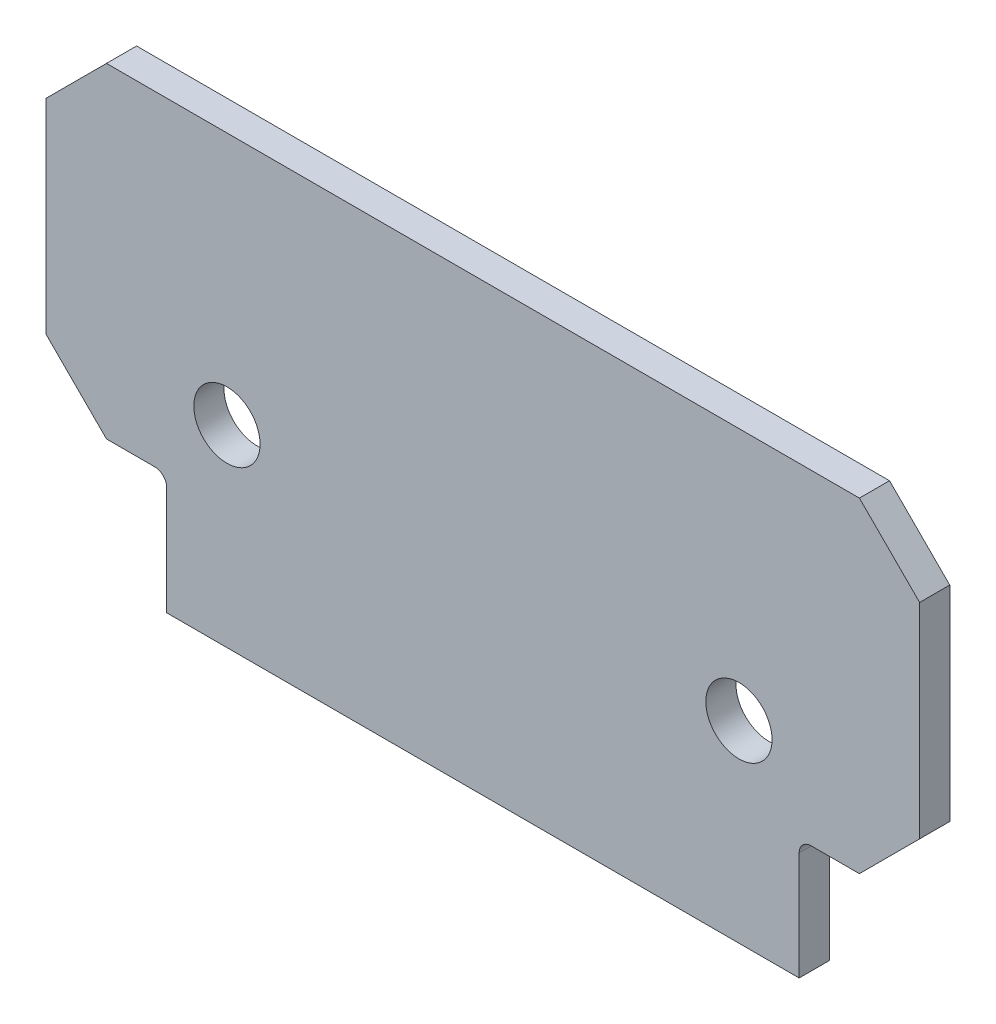
ISO-10303-21;
HEADER;
FILE_DESCRIPTION(('STEP AP214'),'2;1');
FILE_NAME('part.step','',(''),(''),'','','');
FILE_SCHEMA(('AUTOMOTIVE_DESIGN { 1 0 10303 214 1 1 1 1 }'));
ENDSEC;
DATA;
#1=APPLICATION_CONTEXT('core data for automotive mechanical design processes');
#2=APPLICATION_PROTOCOL_DEFINITION('international standard','automotive_design',2000,#1);
#3=PRODUCT_CONTEXT('',#1,'mechanical');
#4=PRODUCT('Part','Part','',(#3));
#5=PRODUCT_RELATED_PRODUCT_CATEGORY('part','',(#4));
#6=PRODUCT_DEFINITION_FORMATION('','',#4);
#7=PRODUCT_DEFINITION_CONTEXT('part definition',#1,'design');
#8=PRODUCT_DEFINITION('design','',#6,#7);
#9=PRODUCT_DEFINITION_SHAPE('','',#8);
#10=(LENGTH_UNIT() NAMED_UNIT(*) SI_UNIT(.MILLI.,.METRE.));
#11=(NAMED_UNIT(*) PLANE_ANGLE_UNIT() SI_UNIT($,.RADIAN.));
#12=(NAMED_UNIT(*) SI_UNIT($,.STERADIAN.) SOLID_ANGLE_UNIT());
#13=UNCERTAINTY_MEASURE_WITH_UNIT(LENGTH_MEASURE(1.E-05),#10,'distance_accuracy_value','');
#14=(GEOMETRIC_REPRESENTATION_CONTEXT(3) GLOBAL_UNCERTAINTY_ASSIGNED_CONTEXT((#13)) GLOBAL_UNIT_ASSIGNED_CONTEXT((#10,
#11,#12)) REPRESENTATION_CONTEXT('',''));
#15=CARTESIAN_POINT('',(0.,0.,0.));
#16=DIRECTION('',(0.,0.,1.));
#17=DIRECTION('',(1.,0.,0.));
#18=AXIS2_PLACEMENT_3D('',#15,#16,#17);
#19=CARTESIAN_POINT('',(0.,-2.2,0.25));
#20=DIRECTION('',(0.,-1.,0.));
#21=DIRECTION('',(1.,0.,0.));
#22=AXIS2_PLACEMENT_3D('',#19,#20,#21);
#23=PLANE('',#22);
#24=DIRECTION('',(-1.,0.,0.));
#25=VECTOR('',#24,1.);
#26=CARTESIAN_POINT('',(0.,-2.2,0.));
#27=LINE('',#26,#25);
#28=CARTESIAN_POINT('',(2.625,-2.2,0.));
#29=VERTEX_POINT('',#28);
#30=CARTESIAN_POINT('',(-2.625,-2.2,0.));
#31=VERTEX_POINT('',#30);
#32=EDGE_CURVE('E258',#29,#31,#27,.T.);
#33=ORIENTED_EDGE('',*,*,#32,.F.);
#34=DIRECTION('',(0.,0.,-1.));
#35=VECTOR('',#34,1.);
#36=CARTESIAN_POINT('',(2.625,-2.2,0.25));
#37=LINE('',#36,#35);
#38=CARTESIAN_POINT('',(2.625,-2.2,0.25));
#39=VERTEX_POINT('',#38);
#40=EDGE_CURVE('E256',#39,#29,#37,.T.);
#41=ORIENTED_EDGE('',*,*,#40,.F.);
#42=DIRECTION('',(-1.,0.,0.));
#43=VECTOR('',#42,1.);
#44=CARTESIAN_POINT('',(0.,-2.2,0.25));
#45=LINE('',#44,#43);
#46=CARTESIAN_POINT('',(-2.625,-2.2,0.25));
#47=VERTEX_POINT('',#46);
#48=EDGE_CURVE('E238',#39,#47,#45,.T.);
#49=ORIENTED_EDGE('',*,*,#48,.T.);
#50=DIRECTION('',(0.,0.,-1.));
#51=VECTOR('',#50,1.);
#52=CARTESIAN_POINT('',(-2.625,-2.2,0.25));
#53=LINE('',#52,#51);
#54=EDGE_CURVE('E277',#47,#31,#53,.T.);
#55=ORIENTED_EDGE('',*,*,#54,.T.);
#56=EDGE_LOOP('',(#33,#41,#49,#55));
#57=FACE_BOUND('',#56,.T.);
#58=ADVANCED_FACE('F63',(#57),#23,.T.);
#59=CARTESIAN_POINT('',(2.625,0.,0.25));
#60=DIRECTION('',(1.,0.,0.));
#61=DIRECTION('',(0.,0.,-1.));
#62=AXIS2_PLACEMENT_3D('',#59,#60,#61);
#63=PLANE('',#62);
#64=DIRECTION('',(0.,-1.,0.));
#65=VECTOR('',#64,1.);
#66=CARTESIAN_POINT('',(2.625,0.,0.));
#67=LINE('',#66,#65);
#68=CARTESIAN_POINT('',(2.625,-1.3,0.));
#69=VERTEX_POINT('',#68);
#70=EDGE_CURVE('E261',#69,#29,#67,.T.);
#71=ORIENTED_EDGE('',*,*,#70,.F.);
#72=DIRECTION('',(0.,0.,-1.));
#73=VECTOR('',#72,1.);
#74=CARTESIAN_POINT('',(2.625,-1.3,0.25));
#75=LINE('',#74,#73);
#76=CARTESIAN_POINT('',(2.625,-1.3,0.25));
#77=VERTEX_POINT('',#76);
#78=EDGE_CURVE('E291',#69,#77,#75,.F.);
#79=ORIENTED_EDGE('',*,*,#78,.T.);
#80=DIRECTION('',(0.,-1.,0.));
#81=VECTOR('',#80,1.);
#82=CARTESIAN_POINT('',(2.625,0.,0.25));
#83=LINE('',#82,#81);
#84=EDGE_CURVE('E242',#77,#39,#83,.T.);
#85=ORIENTED_EDGE('',*,*,#84,.T.);
#86=ORIENTED_EDGE('',*,*,#40,.T.);
#87=EDGE_LOOP('',(#71,#79,#85,#86));
#88=FACE_BOUND('',#87,.T.);
#89=ADVANCED_FACE('F397',(#88),#63,.T.);
#90=CARTESIAN_POINT('',(0.,-1.2,0.25));
#91=DIRECTION('',(0.,-1.,0.));
#92=DIRECTION('',(0.,0.,-1.));
#93=AXIS2_PLACEMENT_3D('',#90,#91,#92);
#94=PLANE('',#93);
#95=DIRECTION('',(-1.,0.,0.));
#96=VECTOR('',#95,1.);
#97=CARTESIAN_POINT('',(0.,-1.2,0.));
#98=LINE('',#97,#96);
#99=CARTESIAN_POINT('',(3.125,-1.2,0.));
#100=VERTEX_POINT('',#99);
#101=CARTESIAN_POINT('',(2.725,-1.2,0.));
#102=VERTEX_POINT('',#101);
#103=EDGE_CURVE('E263',#100,#102,#98,.T.);
#104=ORIENTED_EDGE('',*,*,#103,.F.);
#105=DIRECTION('',(0.,0.,1.));
#106=VECTOR('',#105,1.);
#107=CARTESIAN_POINT('',(3.125,-1.2,0.25));
#108=LINE('',#107,#106);
#109=CARTESIAN_POINT('',(3.125,-1.2,0.25));
#110=VERTEX_POINT('',#109);
#111=EDGE_CURVE('E12',#100,#110,#108,.T.);
#112=ORIENTED_EDGE('',*,*,#111,.T.);
#113=DIRECTION('',(-1.,0.,0.));
#114=VECTOR('',#113,1.);
#115=CARTESIAN_POINT('',(0.,-1.2,0.25));
#116=LINE('',#115,#114);
#117=CARTESIAN_POINT('',(2.725,-1.2,0.25));
#118=VERTEX_POINT('',#117);
#119=EDGE_CURVE('E244',#110,#118,#116,.T.);
#120=ORIENTED_EDGE('',*,*,#119,.T.);
#121=DIRECTION('',(0.,0.,-1.));
#122=VECTOR('',#121,1.);
#123=CARTESIAN_POINT('',(2.725,-1.2,0.));
#124=LINE('',#123,#122);
#125=EDGE_CURVE('E288',#118,#102,#124,.T.);
#126=ORIENTED_EDGE('',*,*,#125,.T.);
#127=EDGE_LOOP('',(#104,#112,#120,#126));
#128=FACE_BOUND('',#127,.T.);
#129=ADVANCED_FACE('F387',(#128),#94,.T.);
#130=CARTESIAN_POINT('',(3.625,0.,0.25));
#131=DIRECTION('',(1.,0.,0.));
#132=DIRECTION('',(0.,1.,0.));
#133=AXIS2_PLACEMENT_3D('',#130,#131,#132);
#134=PLANE('',#133);
#135=DIRECTION('',(0.,-1.,0.));
#136=VECTOR('',#135,1.);
#137=CARTESIAN_POINT('',(3.625,0.,0.25));
#138=LINE('',#137,#136);
#139=CARTESIAN_POINT('',(3.625,0.999999999999998,0.25));
#140=VERTEX_POINT('',#139);
#141=CARTESIAN_POINT('',(3.625,-0.700000000000001,0.25));
#142=VERTEX_POINT('',#141);
#143=EDGE_CURVE('E246',#140,#142,#138,.T.);
#144=ORIENTED_EDGE('',*,*,#143,.T.);
#145=DIRECTION('',(0.,0.,-1.));
#146=VECTOR('',#145,1.);
#147=CARTESIAN_POINT('',(3.625,-0.700000000000001,0.25));
#148=LINE('',#147,#146);
#149=CARTESIAN_POINT('',(3.625,-0.700000000000001,0.));
#150=VERTEX_POINT('',#149);
#151=EDGE_CURVE('E71',#142,#150,#148,.T.);
#152=ORIENTED_EDGE('',*,*,#151,.T.);
#153=DIRECTION('',(0.,-1.,0.));
#154=VECTOR('',#153,1.);
#155=CARTESIAN_POINT('',(3.625,0.,0.));
#156=LINE('',#155,#154);
#157=CARTESIAN_POINT('',(3.625,0.999999999999998,0.));
#158=VERTEX_POINT('',#157);
#159=EDGE_CURVE('E265',#158,#150,#156,.T.);
#160=ORIENTED_EDGE('',*,*,#159,.F.);
#161=DIRECTION('',(0.,0.,1.));
#162=VECTOR('',#161,1.);
#163=CARTESIAN_POINT('',(3.625,0.999999999999998,0.25));
#164=LINE('',#163,#162);
#165=EDGE_CURVE('E330',#158,#140,#164,.T.);
#166=ORIENTED_EDGE('',*,*,#165,.T.);
#167=EDGE_LOOP('',(#144,#152,#160,#166));
#168=FACE_BOUND('',#167,.T.);
#169=ADVANCED_FACE('F335',(#168),#134,.T.);
#170=CARTESIAN_POINT('',(0.,1.5,0.25));
#171=DIRECTION('',(0.,1.,0.));
#172=DIRECTION('',(-1.,0.,0.));
#173=AXIS2_PLACEMENT_3D('',#170,#171,#172);
#174=PLANE('',#173);
#175=DIRECTION('',(1.,0.,0.));
#176=VECTOR('',#175,1.);
#177=CARTESIAN_POINT('',(0.,1.5,0.));
#178=LINE('',#177,#176);
#179=CARTESIAN_POINT('',(-3.125,1.5,0.));
#180=VERTEX_POINT('',#179);
#181=CARTESIAN_POINT('',(3.125,1.5,0.));
#182=VERTEX_POINT('',#181);
#183=EDGE_CURVE('E268',#180,#182,#178,.T.);
#184=ORIENTED_EDGE('',*,*,#183,.F.);
#185=DIRECTION('',(0.,0.,1.));
#186=VECTOR('',#185,1.);
#187=CARTESIAN_POINT('',(-3.125,1.5,0.25));
#188=LINE('',#187,#186);
#189=CARTESIAN_POINT('',(-3.125,1.5,0.25));
#190=VERTEX_POINT('',#189);
#191=EDGE_CURVE('E85',#180,#190,#188,.T.);
#192=ORIENTED_EDGE('',*,*,#191,.T.);
#193=DIRECTION('',(1.,0.,0.));
#194=VECTOR('',#193,1.);
#195=CARTESIAN_POINT('',(0.,1.5,0.25));
#196=LINE('',#195,#194);
#197=CARTESIAN_POINT('',(3.125,1.5,0.25));
#198=VERTEX_POINT('',#197);
#199=EDGE_CURVE('E249',#190,#198,#196,.T.);
#200=ORIENTED_EDGE('',*,*,#199,.T.);
#201=DIRECTION('',(0.,0.,-1.));
#202=VECTOR('',#201,1.);
#203=CARTESIAN_POINT('',(3.125,1.5,0.25));
#204=LINE('',#203,#202);
#205=EDGE_CURVE('E326',#198,#182,#204,.T.);
#206=ORIENTED_EDGE('',*,*,#205,.T.);
#207=EDGE_LOOP('',(#184,#192,#200,#206));
#208=FACE_BOUND('',#207,.T.);
#209=ADVANCED_FACE('F345',(#208),#174,.T.);
#210=CARTESIAN_POINT('',(-3.625,0.,0.25));
#211=DIRECTION('',(1.,0.,0.));
#212=DIRECTION('',(0.,1.,0.));
#213=AXIS2_PLACEMENT_3D('',#210,#211,#212);
#214=PLANE('',#213);
#215=DIRECTION('',(0.,-1.,0.));
#216=VECTOR('',#215,1.);
#217=CARTESIAN_POINT('',(-3.625,0.,0.));
#218=LINE('',#217,#216);
#219=CARTESIAN_POINT('',(-3.625,1.,0.));
#220=VERTEX_POINT('',#219);
#221=CARTESIAN_POINT('',(-3.625,-0.699999999999998,0.));
#222=VERTEX_POINT('',#221);
#223=EDGE_CURVE('E271',#220,#222,#218,.T.);
#224=ORIENTED_EDGE('',*,*,#223,.T.);
#225=DIRECTION('',(0.,0.,1.));
#226=VECTOR('',#225,1.);
#227=CARTESIAN_POINT('',(-3.625,-0.699999999999998,0.25));
#228=LINE('',#227,#226);
#229=CARTESIAN_POINT('',(-3.625,-0.699999999999998,0.25));
#230=VERTEX_POINT('',#229);
#231=EDGE_CURVE('E317',#222,#230,#228,.T.);
#232=ORIENTED_EDGE('',*,*,#231,.T.);
#233=DIRECTION('',(0.,-1.,0.));
#234=VECTOR('',#233,1.);
#235=CARTESIAN_POINT('',(-3.625,0.,0.25));
#236=LINE('',#235,#234);
#237=CARTESIAN_POINT('',(-3.625,1.,0.25));
#238=VERTEX_POINT('',#237);
#239=EDGE_CURVE('E251',#238,#230,#236,.T.);
#240=ORIENTED_EDGE('',*,*,#239,.F.);
#241=DIRECTION('',(0.,0.,-1.));
#242=VECTOR('',#241,1.);
#243=CARTESIAN_POINT('',(-3.625,1.,0.));
#244=LINE('',#243,#242);
#245=EDGE_CURVE('E314',#238,#220,#244,.T.);
#246=ORIENTED_EDGE('',*,*,#245,.T.);
#247=EDGE_LOOP('',(#224,#232,#240,#246));
#248=FACE_BOUND('',#247,.T.);
#249=ADVANCED_FACE('F354',(#248),#214,.F.);
#250=CARTESIAN_POINT('',(0.,-1.2,0.25));
#251=DIRECTION('',(0.,1.,0.));
#252=DIRECTION('',(0.,0.,1.));
#253=AXIS2_PLACEMENT_3D('',#250,#251,#252);
#254=PLANE('',#253);
#255=DIRECTION('',(1.,0.,0.));
#256=VECTOR('',#255,1.);
#257=CARTESIAN_POINT('',(0.,-1.2,0.25));
#258=LINE('',#257,#256);
#259=CARTESIAN_POINT('',(-3.125,-1.2,0.25));
#260=VERTEX_POINT('',#259);
#261=CARTESIAN_POINT('',(-2.725,-1.2,0.25));
#262=VERTEX_POINT('',#261);
#263=EDGE_CURVE('E254',#260,#262,#258,.T.);
#264=ORIENTED_EDGE('',*,*,#263,.F.);
#265=DIRECTION('',(0.,0.,-1.));
#266=VECTOR('',#265,1.);
#267=CARTESIAN_POINT('',(-3.125,-1.2,0.25));
#268=LINE('',#267,#266);
#269=CARTESIAN_POINT('',(-3.125,-1.2,0.));
#270=VERTEX_POINT('',#269);
#271=EDGE_CURVE('E303',#260,#270,#268,.T.);
#272=ORIENTED_EDGE('',*,*,#271,.T.);
#273=DIRECTION('',(1.,0.,0.));
#274=VECTOR('',#273,1.);
#275=CARTESIAN_POINT('',(0.,-1.2,0.));
#276=LINE('',#275,#274);
#277=CARTESIAN_POINT('',(-2.725,-1.2,0.));
#278=VERTEX_POINT('',#277);
#279=EDGE_CURVE('E239',#270,#278,#276,.T.);
#280=ORIENTED_EDGE('',*,*,#279,.T.);
#281=DIRECTION('',(0.,0.,-1.));
#282=VECTOR('',#281,1.);
#283=CARTESIAN_POINT('',(-2.725,-1.2,0.25));
#284=LINE('',#283,#282);
#285=EDGE_CURVE('E285',#278,#262,#284,.F.);
#286=ORIENTED_EDGE('',*,*,#285,.T.);
#287=EDGE_LOOP('',(#264,#272,#280,#286));
#288=FACE_BOUND('',#287,.T.);
#289=ADVANCED_FACE('F362',(#288),#254,.F.);
#290=CARTESIAN_POINT('',(-2.625,0.,0.25));
#291=DIRECTION('',(1.,0.,0.));
#292=DIRECTION('',(0.,0.,-1.));
#293=AXIS2_PLACEMENT_3D('',#290,#291,#292);
#294=PLANE('',#293);
#295=DIRECTION('',(0.,-1.,0.));
#296=VECTOR('',#295,1.);
#297=CARTESIAN_POINT('',(-2.625,0.,0.25));
#298=LINE('',#297,#296);
#299=CARTESIAN_POINT('',(-2.625,-1.3,0.25));
#300=VERTEX_POINT('',#299);
#301=EDGE_CURVE('E236',#300,#47,#298,.T.);
#302=ORIENTED_EDGE('',*,*,#301,.F.);
#303=DIRECTION('',(0.,0.,-1.));
#304=VECTOR('',#303,1.);
#305=CARTESIAN_POINT('',(-2.625,-1.3,0.));
#306=LINE('',#305,#304);
#307=CARTESIAN_POINT('',(-2.625,-1.3,0.));
#308=VERTEX_POINT('',#307);
#309=EDGE_CURVE('E280',#300,#308,#306,.T.);
#310=ORIENTED_EDGE('',*,*,#309,.T.);
#311=DIRECTION('',(0.,-1.,0.));
#312=VECTOR('',#311,1.);
#313=CARTESIAN_POINT('',(-2.625,0.,0.));
#314=LINE('',#313,#312);
#315=EDGE_CURVE('E232',#308,#31,#314,.T.);
#316=ORIENTED_EDGE('',*,*,#315,.T.);
#317=ORIENTED_EDGE('',*,*,#54,.F.);
#318=EDGE_LOOP('',(#302,#310,#316,#317));
#319=FACE_BOUND('',#318,.T.);
#320=ADVANCED_FACE('F371',(#319),#294,.F.);
#321=CARTESIAN_POINT('',(0.,0.,0.));
#322=DIRECTION('',(0.,0.,1.));
#323=DIRECTION('',(1.,0.,0.));
#324=AXIS2_PLACEMENT_3D('',#321,#322,#323);
#325=PLANE('',#324);
#326=CARTESIAN_POINT('',(-2.12499999999998,-0.600000000000007,0.));
#327=DIRECTION('',(0.,0.,1.));
#328=DIRECTION('',(1.,0.,0.));
#329=AXIS2_PLACEMENT_3D('',#326,#327,#328);
#330=CIRCLE('',#329,0.274999999999993);
#331=CARTESIAN_POINT('',(-1.84999999999999,-0.600000000000007,0.));
#332=VERTEX_POINT('',#331);
#333=EDGE_CURVE('E632',#332,#332,#330,.T.);
#334=ORIENTED_EDGE('',*,*,#333,.T.);
#335=EDGE_LOOP('',(#334));
#336=FACE_BOUND('',#335,.T.);
#337=CARTESIAN_POINT('',(2.12500000000001,-0.6,0.));
#338=DIRECTION('',(0.,0.,1.));
#339=DIRECTION('',(1.,0.,0.));
#340=AXIS2_PLACEMENT_3D('',#337,#338,#339);
#341=CIRCLE('',#340,0.274999999999994);
#342=CARTESIAN_POINT('',(2.4,-0.6,0.));
#343=VERTEX_POINT('',#342);
#344=EDGE_CURVE('E228',#343,#343,#341,.T.);
#345=ORIENTED_EDGE('',*,*,#344,.T.);
#346=EDGE_LOOP('',(#345));
#347=FACE_BOUND('',#346,.T.);
#348=DIRECTION('',(0.5,-0.866025403784439,0.));
#349=VECTOR('',#348,1.);
#350=CARTESIAN_POINT('',(-0.720993649053893,-0.416265877365276,0.));
#351=LINE('',#350,#349);
#352=CARTESIAN_POINT('',(-1.25,0.500000000000001,0.));
#353=VERTEX_POINT('',#352);
#354=CARTESIAN_POINT('',(-0.961324865405191,0.,0.));
#355=VERTEX_POINT('',#354);
#356=EDGE_CURVE('E215',#353,#355,#351,.T.);
#357=ORIENTED_EDGE('',*,*,#356,.T.);
#358=DIRECTION('',(1.,0.,0.));
#359=VECTOR('',#358,1.);
#360=CARTESIAN_POINT('',(0.,0.,0.));
#361=LINE('',#360,#359);
#362=CARTESIAN_POINT('',(0.961324865405186,0.,0.));
#363=VERTEX_POINT('',#362);
#364=EDGE_CURVE('E226',#355,#363,#361,.T.);
#365=ORIENTED_EDGE('',*,*,#364,.T.);
#366=DIRECTION('',(0.5,0.866025403784439,0.));
#367=VECTOR('',#366,1.);
#368=CARTESIAN_POINT('',(0.72099364905389,-0.416265877365274,0.));
#369=LINE('',#368,#367);
#370=CARTESIAN_POINT('',(1.25,0.5,0.));
#371=VERTEX_POINT('',#370);
#372=EDGE_CURVE('E195',#363,#371,#369,.T.);
#373=ORIENTED_EDGE('',*,*,#372,.T.);
#374=DIRECTION('',(1.,0.,0.));
#375=VECTOR('',#374,1.);
#376=CARTESIAN_POINT('',(0.,0.500000000000001,0.));
#377=LINE('',#376,#375);
#378=EDGE_CURVE('E218',#353,#371,#377,.T.);
#379=ORIENTED_EDGE('',*,*,#378,.F.);
#380=EDGE_LOOP('',(#357,#365,#373,#379));
#381=FACE_BOUND('',#380,.T.);
#382=ORIENTED_EDGE('',*,*,#279,.F.);
#383=DIRECTION('',(0.707106781186546,-0.707106781186549,0.));
#384=VECTOR('',#383,1.);
#385=CARTESIAN_POINT('',(-3.125,-1.2,0.));
#386=LINE('',#385,#384);
#387=EDGE_CURVE('E312',#270,#222,#386,.F.);
#388=ORIENTED_EDGE('',*,*,#387,.T.);
#389=ORIENTED_EDGE('',*,*,#223,.F.);
#390=DIRECTION('',(0.707106781186549,0.707106781186546,0.));
#391=VECTOR('',#390,1.);
#392=CARTESIAN_POINT('',(-3.625,1.,0.));
#393=LINE('',#392,#391);
#394=EDGE_CURVE('E310',#220,#180,#393,.T.);
#395=ORIENTED_EDGE('',*,*,#394,.T.);
#396=ORIENTED_EDGE('',*,*,#183,.T.);
#397=DIRECTION('',(-0.707106781186546,0.707106781186549,0.));
#398=VECTOR('',#397,1.);
#399=CARTESIAN_POINT('',(3.125,1.5,0.));
#400=LINE('',#399,#398);
#401=EDGE_CURVE('E306',#182,#158,#400,.F.);
#402=ORIENTED_EDGE('',*,*,#401,.T.);
#403=ORIENTED_EDGE('',*,*,#159,.T.);
#404=DIRECTION('',(0.707106781186549,0.707106781186546,0.));
#405=VECTOR('',#404,1.);
#406=CARTESIAN_POINT('',(3.625,-0.700000000000001,0.));
#407=LINE('',#406,#405);
#408=EDGE_CURVE('E308',#150,#100,#407,.F.);
#409=ORIENTED_EDGE('',*,*,#408,.T.);
#410=ORIENTED_EDGE('',*,*,#103,.T.);
#411=CARTESIAN_POINT('',(2.725,-1.3,0.));
#412=DIRECTION('',(0.,0.,1.));
#413=DIRECTION('',(1.,0.,0.));
#414=AXIS2_PLACEMENT_3D('',#411,#412,#413);
#415=CIRCLE('',#414,0.1);
#416=EDGE_CURVE('E298',#102,#69,#415,.T.);
#417=ORIENTED_EDGE('',*,*,#416,.T.);
#418=ORIENTED_EDGE('',*,*,#70,.T.);
#419=ORIENTED_EDGE('',*,*,#32,.T.);
#420=ORIENTED_EDGE('',*,*,#315,.F.);
#421=CARTESIAN_POINT('',(-2.725,-1.3,0.));
#422=DIRECTION('',(0.,0.,1.));
#423=DIRECTION('',(1.,0.,0.));
#424=AXIS2_PLACEMENT_3D('',#421,#422,#423);
#425=CIRCLE('',#424,0.1);
#426=EDGE_CURVE('E293',#308,#278,#425,.T.);
#427=ORIENTED_EDGE('',*,*,#426,.T.);
#428=EDGE_LOOP('',(#382,#388,#389,#395,#396,#402,#403,#409,#410,#417,#418,#419,#420,#427));
#429=FACE_BOUND('',#428,.T.);
#430=ADVANCED_FACE('F341',(#336,#347,#381,#429),#325,.F.);
#431=CARTESIAN_POINT('',(0.,0.,0.25));
#432=DIRECTION('',(0.,0.,1.));
#433=DIRECTION('',(1.,0.,0.));
#434=AXIS2_PLACEMENT_3D('',#431,#432,#433);
#435=PLANE('',#434);
#436=CARTESIAN_POINT('',(-2.12499999999998,-0.600000000000007,0.250000000000001));
#437=DIRECTION('',(0.,0.,1.));
#438=DIRECTION('',(1.,0.,0.));
#439=AXIS2_PLACEMENT_3D('',#436,#437,#438);
#440=CIRCLE('',#439,0.274999999999987);
#441=CARTESIAN_POINT('',(-1.84999999999999,-0.600000000000007,0.250000000000001));
#442=VERTEX_POINT('',#441);
#443=EDGE_CURVE('E629',#442,#442,#440,.T.);
#444=ORIENTED_EDGE('',*,*,#443,.F.);
#445=EDGE_LOOP('',(#444));
#446=FACE_BOUND('',#445,.T.);
#447=CARTESIAN_POINT('',(2.12500000000001,-0.6,0.250000000000001));
#448=DIRECTION('',(0.,0.,1.));
#449=DIRECTION('',(1.,0.,0.));
#450=AXIS2_PLACEMENT_3D('',#447,#448,#449);
#451=CIRCLE('',#450,0.274999999999987);
#452=CARTESIAN_POINT('',(2.4,-0.6,0.250000000000001));
#453=VERTEX_POINT('',#452);
#454=EDGE_CURVE('E221',#453,#453,#451,.T.);
#455=ORIENTED_EDGE('',*,*,#454,.F.);
#456=EDGE_LOOP('',(#455));
#457=FACE_BOUND('',#456,.T.);
#458=ORIENTED_EDGE('',*,*,#239,.T.);
#459=DIRECTION('',(-0.707106781186546,0.707106781186549,0.));
#460=VECTOR('',#459,1.);
#461=CARTESIAN_POINT('',(-2.16250000000001,-2.1625,0.25));
#462=LINE('',#461,#460);
#463=EDGE_CURVE('E324',#230,#260,#462,.F.);
#464=ORIENTED_EDGE('',*,*,#463,.T.);
#465=ORIENTED_EDGE('',*,*,#263,.T.);
#466=CARTESIAN_POINT('',(-2.725,-1.3,0.25));
#467=DIRECTION('',(0.,0.,1.));
#468=DIRECTION('',(1.,0.,0.));
#469=AXIS2_PLACEMENT_3D('',#466,#467,#468);
#470=CIRCLE('',#469,0.1);
#471=EDGE_CURVE('E296',#262,#300,#470,.F.);
#472=ORIENTED_EDGE('',*,*,#471,.T.);
#473=ORIENTED_EDGE('',*,*,#301,.T.);
#474=ORIENTED_EDGE('',*,*,#48,.F.);
#475=ORIENTED_EDGE('',*,*,#84,.F.);
#476=CARTESIAN_POINT('',(2.725,-1.3,0.25));
#477=DIRECTION('',(0.,0.,1.));
#478=DIRECTION('',(1.,0.,0.));
#479=AXIS2_PLACEMENT_3D('',#476,#477,#478);
#480=CIRCLE('',#479,0.1);
#481=EDGE_CURVE('E300',#77,#118,#480,.F.);
#482=ORIENTED_EDGE('',*,*,#481,.T.);
#483=ORIENTED_EDGE('',*,*,#119,.F.);
#484=DIRECTION('',(-0.707106781186549,-0.707106781186546,0.));
#485=VECTOR('',#484,1.);
#486=CARTESIAN_POINT('',(2.16249999999999,-2.1625,0.25));
#487=LINE('',#486,#485);
#488=EDGE_CURVE('E320',#110,#142,#487,.F.);
#489=ORIENTED_EDGE('',*,*,#488,.T.);
#490=ORIENTED_EDGE('',*,*,#143,.F.);
#491=DIRECTION('',(0.707106781186546,-0.707106781186549,0.));
#492=VECTOR('',#491,1.);
#493=CARTESIAN_POINT('',(2.3125,2.3125,0.25));
#494=LINE('',#493,#492);
#495=EDGE_CURVE('E78',#140,#198,#494,.F.);
#496=ORIENTED_EDGE('',*,*,#495,.T.);
#497=ORIENTED_EDGE('',*,*,#199,.F.);
#498=DIRECTION('',(-0.707106781186549,-0.707106781186546,0.));
#499=VECTOR('',#498,1.);
#500=CARTESIAN_POINT('',(-2.31249999999999,2.3125,0.25));
#501=LINE('',#500,#499);
#502=EDGE_CURVE('E322',#190,#238,#501,.T.);
#503=ORIENTED_EDGE('',*,*,#502,.T.);
#504=EDGE_LOOP('',(#458,#464,#465,#472,#473,#474,#475,#482,#483,#489,#490,#496,#497,#503));
#505=FACE_BOUND('',#504,.T.);
#506=ADVANCED_FACE('F347',(#446,#457,#505),#435,.T.);
#507=CARTESIAN_POINT('',(0.,0.,-0.5));
#508=DIRECTION('',(0.,-1.,0.));
#509=DIRECTION('',(0.,0.,-1.));
#510=AXIS2_PLACEMENT_3D('',#507,#508,#509);
#511=PLANE('',#510);
#512=ORIENTED_EDGE('',*,*,#364,.F.);
#513=DIRECTION('',(0.,0.,1.));
#514=VECTOR('',#513,1.);
#515=CARTESIAN_POINT('',(-0.961324865405191,0.,-0.5));
#516=LINE('',#515,#514);
#517=CARTESIAN_POINT('',(-0.961324865405191,0.,-0.5));
#518=VERTEX_POINT('',#517);
#519=EDGE_CURVE('E214',#518,#355,#516,.T.);
#520=ORIENTED_EDGE('',*,*,#519,.F.);
#521=DIRECTION('',(1.,0.,0.));
#522=VECTOR('',#521,1.);
#523=CARTESIAN_POINT('',(0.,0.,-0.5));
#524=LINE('',#523,#522);
#525=CARTESIAN_POINT('',(0.961324865405186,0.,-0.5));
#526=VERTEX_POINT('',#525);
#527=EDGE_CURVE('E207',#518,#526,#524,.T.);
#528=ORIENTED_EDGE('',*,*,#527,.T.);
#529=DIRECTION('',(0.,0.,1.));
#530=VECTOR('',#529,1.);
#531=CARTESIAN_POINT('',(0.961324865405186,0.,-0.5));
#532=LINE('',#531,#530);
#533=EDGE_CURVE('E189',#526,#363,#532,.T.);
#534=ORIENTED_EDGE('',*,*,#533,.T.);
#535=EDGE_LOOP('',(#512,#520,#528,#534));
#536=FACE_BOUND('',#535,.T.);
#537=ADVANCED_FACE('F213',(#536),#511,.T.);
#538=CARTESIAN_POINT('',(-0.720993649053893,-0.416265877365276,-0.5));
#539=DIRECTION('',(-0.866025403784439,-0.5,0.));
#540=DIRECTION('',(0.5,-0.866025403784439,0.));
#541=AXIS2_PLACEMENT_3D('',#538,#539,#540);
#542=PLANE('',#541);
#543=ORIENTED_EDGE('',*,*,#356,.F.);
#544=DIRECTION('',(0.,0.,1.));
#545=VECTOR('',#544,1.);
#546=CARTESIAN_POINT('',(-1.25,0.500000000000001,-0.5));
#547=LINE('',#546,#545);
#548=CARTESIAN_POINT('',(-1.25,0.500000000000001,-0.5));
#549=VERTEX_POINT('',#548);
#550=EDGE_CURVE('E233',#549,#353,#547,.T.);
#551=ORIENTED_EDGE('',*,*,#550,.F.);
#552=DIRECTION('',(0.5,-0.866025403784439,0.));
#553=VECTOR('',#552,1.);
#554=CARTESIAN_POINT('',(-0.720993649053893,-0.416265877365276,-0.5));
#555=LINE('',#554,#553);
#556=EDGE_CURVE('E201',#549,#518,#555,.T.);
#557=ORIENTED_EDGE('',*,*,#556,.T.);
#558=ORIENTED_EDGE('',*,*,#519,.T.);
#559=EDGE_LOOP('',(#543,#551,#557,#558));
#560=FACE_BOUND('',#559,.T.);
#561=ADVANCED_FACE('F488',(#560),#542,.T.);
#562=CARTESIAN_POINT('',(0.,0.500000000000001,-0.5));
#563=DIRECTION('',(0.,-1.,0.));
#564=DIRECTION('',(1.,0.,0.));
#565=AXIS2_PLACEMENT_3D('',#562,#563,#564);
#566=PLANE('',#565);
#567=ORIENTED_EDGE('',*,*,#378,.T.);
#568=DIRECTION('',(0.,0.,1.));
#569=VECTOR('',#568,1.);
#570=CARTESIAN_POINT('',(1.25,0.5,-0.5));
#571=LINE('',#570,#569);
#572=CARTESIAN_POINT('',(1.25,0.5,-0.5));
#573=VERTEX_POINT('',#572);
#574=EDGE_CURVE('E200',#573,#371,#571,.T.);
#575=ORIENTED_EDGE('',*,*,#574,.F.);
#576=DIRECTION('',(1.,0.,0.));
#577=VECTOR('',#576,1.);
#578=CARTESIAN_POINT('',(0.,0.500000000000001,-0.5));
#579=LINE('',#578,#577);
#580=EDGE_CURVE('E210',#549,#573,#579,.T.);
#581=ORIENTED_EDGE('',*,*,#580,.F.);
#582=ORIENTED_EDGE('',*,*,#550,.T.);
#583=EDGE_LOOP('',(#567,#575,#581,#582));
#584=FACE_BOUND('',#583,.T.);
#585=ADVANCED_FACE('F480',(#584),#566,.F.);
#586=CARTESIAN_POINT('',(0.72099364905389,-0.416265877365274,-0.5));
#587=DIRECTION('',(0.866025403784439,-0.5,0.));
#588=DIRECTION('',(0.5,0.866025403784439,0.));
#589=AXIS2_PLACEMENT_3D('',#586,#587,#588);
#590=PLANE('',#589);
#591=ORIENTED_EDGE('',*,*,#372,.F.);
#592=ORIENTED_EDGE('',*,*,#533,.F.);
#593=DIRECTION('',(0.5,0.866025403784439,0.));
#594=VECTOR('',#593,1.);
#595=CARTESIAN_POINT('',(0.72099364905389,-0.416265877365274,-0.5));
#596=LINE('',#595,#594);
#597=EDGE_CURVE('E193',#526,#573,#596,.T.);
#598=ORIENTED_EDGE('',*,*,#597,.T.);
#599=ORIENTED_EDGE('',*,*,#574,.T.);
#600=EDGE_LOOP('',(#591,#592,#598,#599));
#601=FACE_BOUND('',#600,.T.);
#602=ADVANCED_FACE('F191',(#601),#590,.T.);
#603=CARTESIAN_POINT('',(0.,0.,-0.5));
#604=DIRECTION('',(0.,0.,1.));
#605=DIRECTION('',(1.,0.,0.));
#606=AXIS2_PLACEMENT_3D('',#603,#604,#605);
#607=PLANE('',#606);
#608=ORIENTED_EDGE('',*,*,#527,.F.);
#609=ORIENTED_EDGE('',*,*,#556,.F.);
#610=ORIENTED_EDGE('',*,*,#580,.T.);
#611=ORIENTED_EDGE('',*,*,#597,.F.);
#612=EDGE_LOOP('',(#608,#609,#610,#611));
#613=FACE_BOUND('',#612,.T.);
#614=ADVANCED_FACE('F205',(#613),#607,.F.);
#615=CARTESIAN_POINT('',(2.12500000000001,-0.6,0.25));
#616=DIRECTION('',(0.,0.,1.));
#617=DIRECTION('',(1.,0.,0.));
#618=AXIS2_PLACEMENT_3D('',#615,#616,#617);
#619=CYLINDRICAL_SURFACE('',#618,0.274999999999994);
#620=ORIENTED_EDGE('',*,*,#454,.T.);
#621=EDGE_LOOP('',(#620));
#622=FACE_BOUND('',#621,.T.);
#623=ORIENTED_EDGE('',*,*,#344,.F.);
#624=EDGE_LOOP('',(#623));
#625=FACE_BOUND('',#624,.T.);
#626=ADVANCED_FACE('F455',(#622,#625),#619,.F.);
#627=CARTESIAN_POINT('',(-2.12499999999998,-0.600000000000007,0.25));
#628=DIRECTION('',(0.,0.,1.));
#629=DIRECTION('',(1.,0.,0.));
#630=AXIS2_PLACEMENT_3D('',#627,#628,#629);
#631=CYLINDRICAL_SURFACE('',#630,0.274999999999993);
#632=ORIENTED_EDGE('',*,*,#443,.T.);
#633=EDGE_LOOP('',(#632));
#634=FACE_BOUND('',#633,.T.);
#635=ORIENTED_EDGE('',*,*,#333,.F.);
#636=EDGE_LOOP('',(#635));
#637=FACE_BOUND('',#636,.T.);
#638=ADVANCED_FACE('F409',(#634,#637),#631,.F.);
#639=CARTESIAN_POINT('',(-2.725,-1.3,0.25));
#640=DIRECTION('',(0.,0.,1.));
#641=DIRECTION('',(1.,0.,0.));
#642=AXIS2_PLACEMENT_3D('',#639,#640,#641);
#643=CYLINDRICAL_SURFACE('',#642,0.1);
#644=ORIENTED_EDGE('',*,*,#471,.F.);
#645=ORIENTED_EDGE('',*,*,#285,.F.);
#646=ORIENTED_EDGE('',*,*,#426,.F.);
#647=ORIENTED_EDGE('',*,*,#309,.F.);
#648=EDGE_LOOP('',(#644,#645,#646,#647));
#649=FACE_BOUND('',#648,.T.);
#650=ADVANCED_FACE('F373',(#649),#643,.F.);
#651=CARTESIAN_POINT('',(2.725,-1.3,0.25));
#652=DIRECTION('',(0.,0.,1.));
#653=DIRECTION('',(1.,0.,0.));
#654=AXIS2_PLACEMENT_3D('',#651,#652,#653);
#655=CYLINDRICAL_SURFACE('',#654,0.1);
#656=ORIENTED_EDGE('',*,*,#481,.F.);
#657=ORIENTED_EDGE('',*,*,#78,.F.);
#658=ORIENTED_EDGE('',*,*,#416,.F.);
#659=ORIENTED_EDGE('',*,*,#125,.F.);
#660=EDGE_LOOP('',(#656,#657,#658,#659));
#661=FACE_BOUND('',#660,.T.);
#662=ADVANCED_FACE('F384',(#661),#655,.F.);
#663=CARTESIAN_POINT('',(-3.125,-1.2,0.25));
#664=DIRECTION('',(0.707106781186549,0.707106781186546,0.));
#665=DIRECTION('',(0.,0.,-1.));
#666=AXIS2_PLACEMENT_3D('',#663,#664,#665);
#667=PLANE('',#666);
#668=ORIENTED_EDGE('',*,*,#463,.F.);
#669=ORIENTED_EDGE('',*,*,#231,.F.);
#670=ORIENTED_EDGE('',*,*,#387,.F.);
#671=ORIENTED_EDGE('',*,*,#271,.F.);
#672=EDGE_LOOP('',(#668,#669,#670,#671));
#673=FACE_BOUND('',#672,.T.);
#674=ADVANCED_FACE('F359',(#673),#667,.F.);
#675=CARTESIAN_POINT('',(-3.625,1.,0.25));
#676=DIRECTION('',(-0.707106781186546,0.707106781186549,0.));
#677=DIRECTION('',(0.,0.,1.));
#678=AXIS2_PLACEMENT_3D('',#675,#676,#677);
#679=PLANE('',#678);
#680=ORIENTED_EDGE('',*,*,#502,.F.);
#681=ORIENTED_EDGE('',*,*,#191,.F.);
#682=ORIENTED_EDGE('',*,*,#394,.F.);
#683=ORIENTED_EDGE('',*,*,#245,.F.);
#684=EDGE_LOOP('',(#680,#681,#682,#683));
#685=FACE_BOUND('',#684,.T.);
#686=ADVANCED_FACE('F351',(#685),#679,.T.);
#687=CARTESIAN_POINT('',(3.625,-0.700000000000001,0.25));
#688=DIRECTION('',(-0.707106781186546,0.707106781186549,0.));
#689=DIRECTION('',(0.,0.,-1.));
#690=AXIS2_PLACEMENT_3D('',#687,#688,#689);
#691=PLANE('',#690);
#692=ORIENTED_EDGE('',*,*,#488,.F.);
#693=ORIENTED_EDGE('',*,*,#111,.F.);
#694=ORIENTED_EDGE('',*,*,#408,.F.);
#695=ORIENTED_EDGE('',*,*,#151,.F.);
#696=EDGE_LOOP('',(#692,#693,#694,#695));
#697=FACE_BOUND('',#696,.T.);
#698=ADVANCED_FACE('F389',(#697),#691,.F.);
#699=CARTESIAN_POINT('',(3.125,1.5,0.25));
#700=DIRECTION('',(-0.707106781186549,-0.707106781186546,0.));
#701=DIRECTION('',(0.,0.,-1.));
#702=AXIS2_PLACEMENT_3D('',#699,#700,#701);
#703=PLANE('',#702);
#704=ORIENTED_EDGE('',*,*,#495,.F.);
#705=ORIENTED_EDGE('',*,*,#165,.F.);
#706=ORIENTED_EDGE('',*,*,#401,.F.);
#707=ORIENTED_EDGE('',*,*,#205,.F.);
#708=EDGE_LOOP('',(#704,#705,#706,#707));
#709=FACE_BOUND('',#708,.T.);
#710=ADVANCED_FACE('F65',(#709),#703,.F.);
#711=CLOSED_SHELL('',(#58,#89,#129,#169,#209,#249,#289,#320,#430,#506,#537,#561,#585,#602,#614,
#626,#638,#650,#662,#674,#686,#698,#710));
#712=MANIFOLD_SOLID_BREP('B2',#711);
#713=ADVANCED_BREP_SHAPE_REPRESENTATION('',(#18,#712),#14);
#714=SHAPE_DEFINITION_REPRESENTATION(#9,#713);
ENDSEC;
END-ISO-10303-21;
